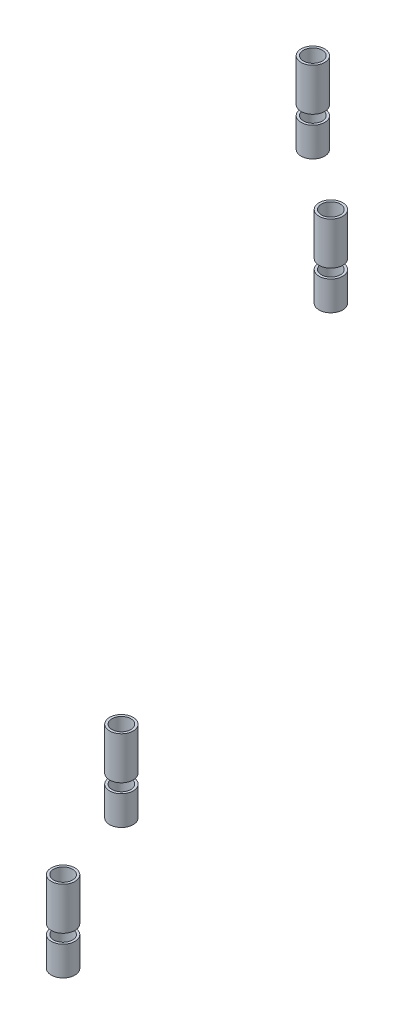
ISO-10303-21;
HEADER;
FILE_DESCRIPTION(('STEP AP214'),'2;1');
FILE_NAME('part.step','',(''),(''),'','','');
FILE_SCHEMA(('AUTOMOTIVE_DESIGN { 1 0 10303 214 1 1 1 1 }'));
ENDSEC;
DATA;
#1=APPLICATION_CONTEXT('core data for automotive mechanical design processes');
#2=APPLICATION_PROTOCOL_DEFINITION('international standard','automotive_design',2000,#1);
#3=PRODUCT_CONTEXT('',#1,'mechanical');
#4=PRODUCT('Part','Part','',(#3));
#5=PRODUCT_RELATED_PRODUCT_CATEGORY('part','',(#4));
#6=PRODUCT_DEFINITION_FORMATION('','',#4);
#7=PRODUCT_DEFINITION_CONTEXT('part definition',#1,'design');
#8=PRODUCT_DEFINITION('design','',#6,#7);
#9=PRODUCT_DEFINITION_SHAPE('','',#8);
#10=(LENGTH_UNIT() NAMED_UNIT(*) SI_UNIT(.MILLI.,.METRE.));
#11=(NAMED_UNIT(*) PLANE_ANGLE_UNIT() SI_UNIT($,.RADIAN.));
#12=(NAMED_UNIT(*) SI_UNIT($,.STERADIAN.) SOLID_ANGLE_UNIT());
#13=UNCERTAINTY_MEASURE_WITH_UNIT(LENGTH_MEASURE(1.E-05),#10,'distance_accuracy_value','');
#14=(GEOMETRIC_REPRESENTATION_CONTEXT(3) GLOBAL_UNCERTAINTY_ASSIGNED_CONTEXT((#13)) GLOBAL_UNIT_ASSIGNED_CONTEXT((#10,
#11,#12)) REPRESENTATION_CONTEXT('',''));
#15=CARTESIAN_POINT('',(0.,0.,0.));
#16=DIRECTION('',(0.,0.,1.));
#17=DIRECTION('',(1.,0.,0.));
#18=AXIS2_PLACEMENT_3D('',#15,#16,#17);
#19=CARTESIAN_POINT('',(-85.5135337309305,461.5,411.920534849113));
#20=DIRECTION('',(0.,-1.,0.));
#21=DIRECTION('',(0.,0.,-1.));
#22=AXIS2_PLACEMENT_3D('',#19,#20,#21);
#23=PLANE('',#22);
#24=CARTESIAN_POINT('',(-85.5135337309305,461.5,411.920534849113));
#25=DIRECTION('',(0.,-1.,0.));
#26=DIRECTION('',(0.,0.,-1.));
#27=AXIS2_PLACEMENT_3D('',#24,#25,#26);
#28=CIRCLE('',#27,2.50000000000001);
#29=CARTESIAN_POINT('',(-85.5135337309305,461.5,409.420534849113));
#30=VERTEX_POINT('',#29);
#31=EDGE_CURVE('E49',#30,#30,#28,.T.);
#32=ORIENTED_EDGE('',*,*,#31,.F.);
#33=EDGE_LOOP('',(#32));
#34=FACE_BOUND('',#33,.T.);
#35=CARTESIAN_POINT('',(-85.5135337309305,461.5,411.920534849113));
#36=DIRECTION('',(0.,-1.,0.));
#37=DIRECTION('',(0.,0.,-1.));
#38=AXIS2_PLACEMENT_3D('',#35,#36,#37);
#39=CIRCLE('',#38,1.99999999999998);
#40=CARTESIAN_POINT('',(-85.5135337309305,461.5,409.920534849113));
#41=VERTEX_POINT('',#40);
#42=EDGE_CURVE('E58',#41,#41,#39,.T.);
#43=ORIENTED_EDGE('',*,*,#42,.T.);
#44=EDGE_LOOP('',(#43));
#45=FACE_BOUND('',#44,.T.);
#46=ADVANCED_FACE('F42',(#34,#45),#23,.F.);
#47=CARTESIAN_POINT('',(-85.5135337309305,448.228932188135,411.920534849113));
#48=DIRECTION('',(0.,1.,0.));
#49=DIRECTION('',(0.,0.,1.));
#50=AXIS2_PLACEMENT_3D('',#47,#48,#49);
#51=CYLINDRICAL_SURFACE('',#50,2.50000000000001);
#52=CARTESIAN_POINT('',(-85.5135337309305,455.3,411.920534849113));
#53=DIRECTION('',(0.,1.,0.));
#54=DIRECTION('',(0.,0.,1.));
#55=AXIS2_PLACEMENT_3D('',#52,#53,#54);
#56=CIRCLE('',#55,2.50000000000001);
#57=CARTESIAN_POINT('',(-85.5135337309305,455.3,414.420534849113));
#58=VERTEX_POINT('',#57);
#59=EDGE_CURVE('E53',#58,#58,#56,.T.);
#60=ORIENTED_EDGE('',*,*,#59,.T.);
#61=EDGE_LOOP('',(#60));
#62=FACE_BOUND('',#61,.T.);
#63=ORIENTED_EDGE('',*,*,#31,.T.);
#64=EDGE_LOOP('',(#63));
#65=FACE_BOUND('',#64,.T.);
#66=ADVANCED_FACE('F66',(#62,#65),#51,.T.);
#67=CARTESIAN_POINT('',(-85.5135337309305,448.228932188135,411.920534849113));
#68=DIRECTION('',(0.,1.,0.));
#69=DIRECTION('',(0.,0.,1.));
#70=AXIS2_PLACEMENT_3D('',#67,#68,#69);
#71=CYLINDRICAL_SURFACE('',#70,1.99999999999998);
#72=CARTESIAN_POINT('',(-85.5135337309305,455.3,411.920534849113));
#73=DIRECTION('',(0.,1.,0.));
#74=DIRECTION('',(0.,0.,1.));
#75=AXIS2_PLACEMENT_3D('',#72,#73,#74);
#76=CIRCLE('',#75,1.99999999999998);
#77=CARTESIAN_POINT('',(-85.5135337309305,455.3,413.920534849113));
#78=VERTEX_POINT('',#77);
#79=EDGE_CURVE('E11',#78,#78,#76,.T.);
#80=ORIENTED_EDGE('',*,*,#79,.F.);
#81=EDGE_LOOP('',(#80));
#82=FACE_BOUND('',#81,.T.);
#83=ORIENTED_EDGE('',*,*,#42,.F.);
#84=EDGE_LOOP('',(#83));
#85=FACE_BOUND('',#84,.T.);
#86=ADVANCED_FACE('F64',(#82,#85),#71,.F.);
#87=CARTESIAN_POINT('',(-199.166238959109,455.3,261.544556892225));
#88=DIRECTION('',(0.,1.,0.));
#89=DIRECTION('',(0.,0.,1.));
#90=AXIS2_PLACEMENT_3D('',#87,#88,#89);
#91=PLANE('',#90);
#92=ORIENTED_EDGE('',*,*,#79,.T.);
#93=EDGE_LOOP('',(#92));
#94=FACE_BOUND('',#93,.T.);
#95=ORIENTED_EDGE('',*,*,#59,.F.);
#96=EDGE_LOOP('',(#95));
#97=FACE_BOUND('',#96,.T.);
#98=ADVANCED_FACE('F44',(#94,#97),#91,.F.);
#99=CLOSED_SHELL('',(#46,#66,#86,#98));
#100=MANIFOLD_SOLID_BREP('B2',#99);
#101=CARTESIAN_POINT('',(-106.941386537863,461.5,378.144106321449));
#102=DIRECTION('',(0.,-1.,0.));
#103=DIRECTION('',(0.,0.,-1.));
#104=AXIS2_PLACEMENT_3D('',#101,#102,#103);
#105=PLANE('',#104);
#106=CARTESIAN_POINT('',(-106.941386537863,461.5,378.144106321449));
#107=DIRECTION('',(0.,-1.,0.));
#108=DIRECTION('',(0.,0.,-1.));
#109=AXIS2_PLACEMENT_3D('',#106,#107,#108);
#110=CIRCLE('',#109,2.50000000000002);
#111=CARTESIAN_POINT('',(-106.941386537863,461.5,375.644106321449));
#112=VERTEX_POINT('',#111);
#113=EDGE_CURVE('E119',#112,#112,#110,.T.);
#114=ORIENTED_EDGE('',*,*,#113,.F.);
#115=EDGE_LOOP('',(#114));
#116=FACE_BOUND('',#115,.T.);
#117=CARTESIAN_POINT('',(-106.941386537863,461.5,378.144106321449));
#118=DIRECTION('',(0.,-1.,0.));
#119=DIRECTION('',(0.,0.,-1.));
#120=AXIS2_PLACEMENT_3D('',#117,#118,#119);
#121=CIRCLE('',#120,2.00000000000001);
#122=CARTESIAN_POINT('',(-106.941386537863,461.5,376.144106321449));
#123=VERTEX_POINT('',#122);
#124=EDGE_CURVE('E128',#123,#123,#121,.T.);
#125=ORIENTED_EDGE('',*,*,#124,.T.);
#126=EDGE_LOOP('',(#125));
#127=FACE_BOUND('',#126,.T.);
#128=ADVANCED_FACE('F112',(#116,#127),#105,.F.);
#129=CARTESIAN_POINT('',(-106.941386537863,448.228932188135,378.144106321449));
#130=DIRECTION('',(0.,1.,0.));
#131=DIRECTION('',(0.,0.,1.));
#132=AXIS2_PLACEMENT_3D('',#129,#130,#131);
#133=CYLINDRICAL_SURFACE('',#132,2.50000000000002);
#134=CARTESIAN_POINT('',(-106.941386537863,455.3,378.144106321449));
#135=DIRECTION('',(0.,1.,0.));
#136=DIRECTION('',(0.,0.,1.));
#137=AXIS2_PLACEMENT_3D('',#134,#135,#136);
#138=CIRCLE('',#137,2.50000000000002);
#139=CARTESIAN_POINT('',(-106.941386537863,455.3,380.644106321449));
#140=VERTEX_POINT('',#139);
#141=EDGE_CURVE('E123',#140,#140,#138,.T.);
#142=ORIENTED_EDGE('',*,*,#141,.T.);
#143=EDGE_LOOP('',(#142));
#144=FACE_BOUND('',#143,.T.);
#145=ORIENTED_EDGE('',*,*,#113,.T.);
#146=EDGE_LOOP('',(#145));
#147=FACE_BOUND('',#146,.T.);
#148=ADVANCED_FACE('F136',(#144,#147),#133,.T.);
#149=CARTESIAN_POINT('',(-106.941386537863,448.228932188135,378.144106321449));
#150=DIRECTION('',(0.,1.,0.));
#151=DIRECTION('',(0.,0.,1.));
#152=AXIS2_PLACEMENT_3D('',#149,#150,#151);
#153=CYLINDRICAL_SURFACE('',#152,2.00000000000001);
#154=CARTESIAN_POINT('',(-106.941386537863,455.3,378.144106321449));
#155=DIRECTION('',(0.,1.,0.));
#156=DIRECTION('',(0.,0.,1.));
#157=AXIS2_PLACEMENT_3D('',#154,#155,#156);
#158=CIRCLE('',#157,2.00000000000001);
#159=CARTESIAN_POINT('',(-106.941386537863,455.3,380.144106321449));
#160=VERTEX_POINT('',#159);
#161=EDGE_CURVE('E41',#160,#160,#158,.T.);
#162=ORIENTED_EDGE('',*,*,#161,.F.);
#163=EDGE_LOOP('',(#162));
#164=FACE_BOUND('',#163,.T.);
#165=ORIENTED_EDGE('',*,*,#124,.F.);
#166=EDGE_LOOP('',(#165));
#167=FACE_BOUND('',#166,.T.);
#168=ADVANCED_FACE('F134',(#164,#167),#153,.F.);
#169=CARTESIAN_POINT('',(-199.166238959109,455.3,261.544556892225));
#170=DIRECTION('',(0.,1.,0.));
#171=DIRECTION('',(0.,0.,1.));
#172=AXIS2_PLACEMENT_3D('',#169,#170,#171);
#173=PLANE('',#172);
#174=ORIENTED_EDGE('',*,*,#161,.T.);
#175=EDGE_LOOP('',(#174));
#176=FACE_BOUND('',#175,.T.);
#177=ORIENTED_EDGE('',*,*,#141,.F.);
#178=EDGE_LOOP('',(#177));
#179=FACE_BOUND('',#178,.T.);
#180=ADVANCED_FACE('F114',(#176,#179),#173,.F.);
#181=CLOSED_SHELL('',(#128,#148,#168,#180));
#182=MANIFOLD_SOLID_BREP('B6',#181);
#183=CARTESIAN_POINT('',(-179.166238959035,461.5,261.544556892205));
#184=DIRECTION('',(0.,-1.,0.));
#185=DIRECTION('',(0.,0.,-1.));
#186=AXIS2_PLACEMENT_3D('',#183,#184,#185);
#187=PLANE('',#186);
#188=CARTESIAN_POINT('',(-179.166238959035,461.5,261.544556892205));
#189=DIRECTION('',(0.,-1.,0.));
#190=DIRECTION('',(0.,0.,-1.));
#191=AXIS2_PLACEMENT_3D('',#188,#189,#190);
#192=CIRCLE('',#191,2.50000000000002);
#193=CARTESIAN_POINT('',(-179.166238959035,461.5,259.044556892205));
#194=VERTEX_POINT('',#193);
#195=EDGE_CURVE('E189',#194,#194,#192,.T.);
#196=ORIENTED_EDGE('',*,*,#195,.F.);
#197=EDGE_LOOP('',(#196));
#198=FACE_BOUND('',#197,.T.);
#199=CARTESIAN_POINT('',(-179.166238959035,461.5,261.544556892205));
#200=DIRECTION('',(0.,-1.,0.));
#201=DIRECTION('',(0.,0.,-1.));
#202=AXIS2_PLACEMENT_3D('',#199,#200,#201);
#203=CIRCLE('',#202,1.99999999694512);
#204=CARTESIAN_POINT('',(-179.166238959035,461.5,259.54455689526));
#205=VERTEX_POINT('',#204);
#206=EDGE_CURVE('E198',#205,#205,#203,.T.);
#207=ORIENTED_EDGE('',*,*,#206,.T.);
#208=EDGE_LOOP('',(#207));
#209=FACE_BOUND('',#208,.T.);
#210=ADVANCED_FACE('F182',(#198,#209),#187,.F.);
#211=CARTESIAN_POINT('',(-179.166238959035,448.228932188135,261.544556892205));
#212=DIRECTION('',(0.,1.,0.));
#213=DIRECTION('',(0.,0.,1.));
#214=AXIS2_PLACEMENT_3D('',#211,#212,#213);
#215=CYLINDRICAL_SURFACE('',#214,2.50000000000002);
#216=CARTESIAN_POINT('',(-179.166238959035,455.3,261.544556892205));
#217=DIRECTION('',(0.,1.,0.));
#218=DIRECTION('',(0.,0.,1.));
#219=AXIS2_PLACEMENT_3D('',#216,#217,#218);
#220=CIRCLE('',#219,2.50000000000002);
#221=CARTESIAN_POINT('',(-179.166238959035,455.3,264.044556892205));
#222=VERTEX_POINT('',#221);
#223=EDGE_CURVE('E193',#222,#222,#220,.T.);
#224=ORIENTED_EDGE('',*,*,#223,.T.);
#225=EDGE_LOOP('',(#224));
#226=FACE_BOUND('',#225,.T.);
#227=ORIENTED_EDGE('',*,*,#195,.T.);
#228=EDGE_LOOP('',(#227));
#229=FACE_BOUND('',#228,.T.);
#230=ADVANCED_FACE('F206',(#226,#229),#215,.T.);
#231=CARTESIAN_POINT('',(-179.166238959035,448.228932188135,261.544556892205));
#232=DIRECTION('',(0.,1.,0.));
#233=DIRECTION('',(0.,0.,1.));
#234=AXIS2_PLACEMENT_3D('',#231,#232,#233);
#235=CYLINDRICAL_SURFACE('',#234,1.99999999694512);
#236=CARTESIAN_POINT('',(-179.166238959035,455.3,261.544556892205));
#237=DIRECTION('',(0.,1.,0.));
#238=DIRECTION('',(0.,0.,1.));
#239=AXIS2_PLACEMENT_3D('',#236,#237,#238);
#240=CIRCLE('',#239,1.99999999694512);
#241=CARTESIAN_POINT('',(-179.166238959035,455.3,263.54455688915));
#242=VERTEX_POINT('',#241);
#243=EDGE_CURVE('E111',#242,#242,#240,.T.);
#244=ORIENTED_EDGE('',*,*,#243,.F.);
#245=EDGE_LOOP('',(#244));
#246=FACE_BOUND('',#245,.T.);
#247=ORIENTED_EDGE('',*,*,#206,.F.);
#248=EDGE_LOOP('',(#247));
#249=FACE_BOUND('',#248,.T.);
#250=ADVANCED_FACE('F204',(#246,#249),#235,.F.);
#251=CARTESIAN_POINT('',(-199.166238959109,455.3,261.544556892225));
#252=DIRECTION('',(0.,1.,0.));
#253=DIRECTION('',(0.,0.,1.));
#254=AXIS2_PLACEMENT_3D('',#251,#252,#253);
#255=PLANE('',#254);
#256=ORIENTED_EDGE('',*,*,#243,.T.);
#257=EDGE_LOOP('',(#256));
#258=FACE_BOUND('',#257,.T.);
#259=ORIENTED_EDGE('',*,*,#223,.F.);
#260=EDGE_LOOP('',(#259));
#261=FACE_BOUND('',#260,.T.);
#262=ADVANCED_FACE('F184',(#258,#261),#255,.F.);
#263=CLOSED_SHELL('',(#210,#230,#250,#262));
#264=MANIFOLD_SOLID_BREP('B36',#263);
#265=CARTESIAN_POINT('',(-209.294177746774,461.5,235.232823684332));
#266=DIRECTION('',(0.,-1.,0.));
#267=DIRECTION('',(0.,0.,-1.));
#268=AXIS2_PLACEMENT_3D('',#265,#266,#267);
#269=PLANE('',#268);
#270=CARTESIAN_POINT('',(-209.294177746774,461.5,235.232823684332));
#271=DIRECTION('',(0.,-1.,0.));
#272=DIRECTION('',(0.,0.,-1.));
#273=AXIS2_PLACEMENT_3D('',#270,#271,#272);
#274=CIRCLE('',#273,2.5);
#275=CARTESIAN_POINT('',(-209.294177746774,461.5,232.732823684332));
#276=VERTEX_POINT('',#275);
#277=EDGE_CURVE('E259',#276,#276,#274,.T.);
#278=ORIENTED_EDGE('',*,*,#277,.F.);
#279=EDGE_LOOP('',(#278));
#280=FACE_BOUND('',#279,.T.);
#281=CARTESIAN_POINT('',(-209.294177746774,461.5,235.232823684332));
#282=DIRECTION('',(0.,-1.,0.));
#283=DIRECTION('',(0.,0.,-1.));
#284=AXIS2_PLACEMENT_3D('',#281,#282,#283);
#285=CIRCLE('',#284,2.00000000306296);
#286=CARTESIAN_POINT('',(-209.294177746774,461.5,233.232823681269));
#287=VERTEX_POINT('',#286);
#288=EDGE_CURVE('E268',#287,#287,#285,.T.);
#289=ORIENTED_EDGE('',*,*,#288,.T.);
#290=EDGE_LOOP('',(#289));
#291=FACE_BOUND('',#290,.T.);
#292=ADVANCED_FACE('F252',(#280,#291),#269,.F.);
#293=CARTESIAN_POINT('',(-209.294177746774,448.228932188135,235.232823684332));
#294=DIRECTION('',(0.,1.,0.));
#295=DIRECTION('',(0.,0.,1.));
#296=AXIS2_PLACEMENT_3D('',#293,#294,#295);
#297=CYLINDRICAL_SURFACE('',#296,2.5);
#298=CARTESIAN_POINT('',(-209.294177746774,455.3,235.232823684332));
#299=DIRECTION('',(0.,1.,0.));
#300=DIRECTION('',(0.,0.,1.));
#301=AXIS2_PLACEMENT_3D('',#298,#299,#300);
#302=CIRCLE('',#301,2.5);
#303=CARTESIAN_POINT('',(-209.294177746774,455.3,237.732823684332));
#304=VERTEX_POINT('',#303);
#305=EDGE_CURVE('E263',#304,#304,#302,.T.);
#306=ORIENTED_EDGE('',*,*,#305,.T.);
#307=EDGE_LOOP('',(#306));
#308=FACE_BOUND('',#307,.T.);
#309=ORIENTED_EDGE('',*,*,#277,.T.);
#310=EDGE_LOOP('',(#309));
#311=FACE_BOUND('',#310,.T.);
#312=ADVANCED_FACE('F276',(#308,#311),#297,.T.);
#313=CARTESIAN_POINT('',(-209.294177746774,448.228932188135,235.232823684332));
#314=DIRECTION('',(0.,1.,0.));
#315=DIRECTION('',(0.,0.,1.));
#316=AXIS2_PLACEMENT_3D('',#313,#314,#315);
#317=CYLINDRICAL_SURFACE('',#316,2.00000000306296);
#318=CARTESIAN_POINT('',(-209.294177746774,455.3,235.232823684332));
#319=DIRECTION('',(0.,1.,0.));
#320=DIRECTION('',(0.,0.,1.));
#321=AXIS2_PLACEMENT_3D('',#318,#319,#320);
#322=CIRCLE('',#321,2.00000000306296);
#323=CARTESIAN_POINT('',(-209.294177746774,455.3,237.232823687395));
#324=VERTEX_POINT('',#323);
#325=EDGE_CURVE('E181',#324,#324,#322,.T.);
#326=ORIENTED_EDGE('',*,*,#325,.F.);
#327=EDGE_LOOP('',(#326));
#328=FACE_BOUND('',#327,.T.);
#329=ORIENTED_EDGE('',*,*,#288,.F.);
#330=EDGE_LOOP('',(#329));
#331=FACE_BOUND('',#330,.T.);
#332=ADVANCED_FACE('F274',(#328,#331),#317,.F.);
#333=CARTESIAN_POINT('',(-199.166238959109,455.3,261.544556892225));
#334=DIRECTION('',(0.,1.,0.));
#335=DIRECTION('',(0.,0.,1.));
#336=AXIS2_PLACEMENT_3D('',#333,#334,#335);
#337=PLANE('',#336);
#338=ORIENTED_EDGE('',*,*,#325,.T.);
#339=EDGE_LOOP('',(#338));
#340=FACE_BOUND('',#339,.T.);
#341=ORIENTED_EDGE('',*,*,#305,.F.);
#342=EDGE_LOOP('',(#341));
#343=FACE_BOUND('',#342,.T.);
#344=ADVANCED_FACE('F254',(#340,#343),#337,.F.);
#345=CLOSED_SHELL('',(#292,#312,#332,#344));
#346=MANIFOLD_SOLID_BREP('B106',#345);
#347=CARTESIAN_POINT('',(-85.5135337309305,472.500000000027,411.920534849113));
#348=DIRECTION('',(0.,-1.,0.));
#349=DIRECTION('',(0.,0.,-1.));
#350=AXIS2_PLACEMENT_3D('',#347,#348,#349);
#351=PLANE('',#350);
#352=CARTESIAN_POINT('',(-85.5135337309305,472.500000000027,411.920534849113));
#353=DIRECTION('',(0.,-1.,0.));
#354=DIRECTION('',(0.,0.,-1.));
#355=AXIS2_PLACEMENT_3D('',#352,#353,#354);
#356=CIRCLE('',#355,2.5);
#357=CARTESIAN_POINT('',(-85.5135337309305,472.500000000027,409.420534849113));
#358=VERTEX_POINT('',#357);
#359=EDGE_CURVE('E329',#358,#358,#356,.T.);
#360=ORIENTED_EDGE('',*,*,#359,.F.);
#361=EDGE_LOOP('',(#360));
#362=FACE_BOUND('',#361,.T.);
#363=CARTESIAN_POINT('',(-85.5135337309305,472.500000000027,411.920534849113));
#364=DIRECTION('',(0.,-1.,0.));
#365=DIRECTION('',(0.,0.,-1.));
#366=AXIS2_PLACEMENT_3D('',#363,#364,#365);
#367=CIRCLE('',#366,2.);
#368=CARTESIAN_POINT('',(-85.5135337309305,472.500000000027,409.920534849113));
#369=VERTEX_POINT('',#368);
#370=EDGE_CURVE('E338',#369,#369,#367,.T.);
#371=ORIENTED_EDGE('',*,*,#370,.T.);
#372=EDGE_LOOP('',(#371));
#373=FACE_BOUND('',#372,.T.);
#374=ADVANCED_FACE('F322',(#362,#373),#351,.F.);
#375=CARTESIAN_POINT('',(-85.5135337309305,456.428932188135,411.920534849113));
#376=DIRECTION('',(0.,1.,0.));
#377=DIRECTION('',(0.,0.,1.));
#378=AXIS2_PLACEMENT_3D('',#375,#376,#377);
#379=CYLINDRICAL_SURFACE('',#378,2.5);
#380=CARTESIAN_POINT('',(-85.5135337309305,463.5,411.920534849113));
#381=DIRECTION('',(0.,1.,0.));
#382=DIRECTION('',(0.,0.,1.));
#383=AXIS2_PLACEMENT_3D('',#380,#381,#382);
#384=CIRCLE('',#383,2.5);
#385=CARTESIAN_POINT('',(-85.5135337309305,463.5,414.420534849113));
#386=VERTEX_POINT('',#385);
#387=EDGE_CURVE('E333',#386,#386,#384,.T.);
#388=ORIENTED_EDGE('',*,*,#387,.T.);
#389=EDGE_LOOP('',(#388));
#390=FACE_BOUND('',#389,.T.);
#391=ORIENTED_EDGE('',*,*,#359,.T.);
#392=EDGE_LOOP('',(#391));
#393=FACE_BOUND('',#392,.T.);
#394=ADVANCED_FACE('F346',(#390,#393),#379,.T.);
#395=CARTESIAN_POINT('',(-85.5135337309305,456.428932188135,411.920534849113));
#396=DIRECTION('',(0.,1.,0.));
#397=DIRECTION('',(0.,0.,1.));
#398=AXIS2_PLACEMENT_3D('',#395,#396,#397);
#399=CYLINDRICAL_SURFACE('',#398,2.);
#400=CARTESIAN_POINT('',(-85.5135337309305,463.5,411.920534849113));
#401=DIRECTION('',(0.,1.,0.));
#402=DIRECTION('',(0.,0.,1.));
#403=AXIS2_PLACEMENT_3D('',#400,#401,#402);
#404=CIRCLE('',#403,2.);
#405=CARTESIAN_POINT('',(-85.5135337309305,463.5,413.920534849113));
#406=VERTEX_POINT('',#405);
#407=EDGE_CURVE('E251',#406,#406,#404,.T.);
#408=ORIENTED_EDGE('',*,*,#407,.F.);
#409=EDGE_LOOP('',(#408));
#410=FACE_BOUND('',#409,.T.);
#411=ORIENTED_EDGE('',*,*,#370,.F.);
#412=EDGE_LOOP('',(#411));
#413=FACE_BOUND('',#412,.T.);
#414=ADVANCED_FACE('F344',(#410,#413),#399,.F.);
#415=CARTESIAN_POINT('',(-268.222443474212,463.5,328.116942343268));
#416=DIRECTION('',(0.,1.,0.));
#417=DIRECTION('',(0.,0.,1.));
#418=AXIS2_PLACEMENT_3D('',#415,#416,#417);
#419=PLANE('',#418);
#420=ORIENTED_EDGE('',*,*,#407,.T.);
#421=EDGE_LOOP('',(#420));
#422=FACE_BOUND('',#421,.T.);
#423=ORIENTED_EDGE('',*,*,#387,.F.);
#424=EDGE_LOOP('',(#423));
#425=FACE_BOUND('',#424,.T.);
#426=ADVANCED_FACE('F324',(#422,#425),#419,.F.);
#427=CLOSED_SHELL('',(#374,#394,#414,#426));
#428=MANIFOLD_SOLID_BREP('B176',#427);
#429=CARTESIAN_POINT('',(-106.941386537863,472.500000000027,378.144106321449));
#430=DIRECTION('',(0.,-1.,0.));
#431=DIRECTION('',(0.,0.,-1.));
#432=AXIS2_PLACEMENT_3D('',#429,#430,#431);
#433=PLANE('',#432);
#434=CARTESIAN_POINT('',(-106.941386537863,472.500000000027,378.144106321449));
#435=DIRECTION('',(0.,-1.,0.));
#436=DIRECTION('',(0.,0.,-1.));
#437=AXIS2_PLACEMENT_3D('',#434,#435,#436);
#438=CIRCLE('',#437,2.5);
#439=CARTESIAN_POINT('',(-106.941386537863,472.500000000027,375.644106321449));
#440=VERTEX_POINT('',#439);
#441=EDGE_CURVE('E399',#440,#440,#438,.T.);
#442=ORIENTED_EDGE('',*,*,#441,.F.);
#443=EDGE_LOOP('',(#442));
#444=FACE_BOUND('',#443,.T.);
#445=CARTESIAN_POINT('',(-106.941386537863,472.500000000027,378.144106321449));
#446=DIRECTION('',(0.,-1.,0.));
#447=DIRECTION('',(0.,0.,-1.));
#448=AXIS2_PLACEMENT_3D('',#445,#446,#447);
#449=CIRCLE('',#448,2.);
#450=CARTESIAN_POINT('',(-106.941386537863,472.500000000027,376.144106321449));
#451=VERTEX_POINT('',#450);
#452=EDGE_CURVE('E408',#451,#451,#449,.T.);
#453=ORIENTED_EDGE('',*,*,#452,.T.);
#454=EDGE_LOOP('',(#453));
#455=FACE_BOUND('',#454,.T.);
#456=ADVANCED_FACE('F392',(#444,#455),#433,.F.);
#457=CARTESIAN_POINT('',(-106.941386537863,456.428932188135,378.144106321449));
#458=DIRECTION('',(0.,1.,0.));
#459=DIRECTION('',(0.,0.,1.));
#460=AXIS2_PLACEMENT_3D('',#457,#458,#459);
#461=CYLINDRICAL_SURFACE('',#460,2.5);
#462=CARTESIAN_POINT('',(-106.941386537863,463.5,378.144106321449));
#463=DIRECTION('',(0.,1.,0.));
#464=DIRECTION('',(0.,0.,1.));
#465=AXIS2_PLACEMENT_3D('',#462,#463,#464);
#466=CIRCLE('',#465,2.5);
#467=CARTESIAN_POINT('',(-106.941386537863,463.5,380.644106321449));
#468=VERTEX_POINT('',#467);
#469=EDGE_CURVE('E403',#468,#468,#466,.T.);
#470=ORIENTED_EDGE('',*,*,#469,.T.);
#471=EDGE_LOOP('',(#470));
#472=FACE_BOUND('',#471,.T.);
#473=ORIENTED_EDGE('',*,*,#441,.T.);
#474=EDGE_LOOP('',(#473));
#475=FACE_BOUND('',#474,.T.);
#476=ADVANCED_FACE('F416',(#472,#475),#461,.T.);
#477=CARTESIAN_POINT('',(-106.941386537863,456.428932188135,378.144106321449));
#478=DIRECTION('',(0.,1.,0.));
#479=DIRECTION('',(0.,0.,1.));
#480=AXIS2_PLACEMENT_3D('',#477,#478,#479);
#481=CYLINDRICAL_SURFACE('',#480,2.);
#482=CARTESIAN_POINT('',(-106.941386537863,463.5,378.144106321449));
#483=DIRECTION('',(0.,1.,0.));
#484=DIRECTION('',(0.,0.,1.));
#485=AXIS2_PLACEMENT_3D('',#482,#483,#484);
#486=CIRCLE('',#485,2.);
#487=CARTESIAN_POINT('',(-106.941386537863,463.5,380.144106321449));
#488=VERTEX_POINT('',#487);
#489=EDGE_CURVE('E321',#488,#488,#486,.T.);
#490=ORIENTED_EDGE('',*,*,#489,.F.);
#491=EDGE_LOOP('',(#490));
#492=FACE_BOUND('',#491,.T.);
#493=ORIENTED_EDGE('',*,*,#452,.F.);
#494=EDGE_LOOP('',(#493));
#495=FACE_BOUND('',#494,.T.);
#496=ADVANCED_FACE('F414',(#492,#495),#481,.F.);
#497=CARTESIAN_POINT('',(-268.222443474212,463.5,328.116942343268));
#498=DIRECTION('',(0.,1.,0.));
#499=DIRECTION('',(0.,0.,1.));
#500=AXIS2_PLACEMENT_3D('',#497,#498,#499);
#501=PLANE('',#500);
#502=ORIENTED_EDGE('',*,*,#489,.T.);
#503=EDGE_LOOP('',(#502));
#504=FACE_BOUND('',#503,.T.);
#505=ORIENTED_EDGE('',*,*,#469,.F.);
#506=EDGE_LOOP('',(#505));
#507=FACE_BOUND('',#506,.T.);
#508=ADVANCED_FACE('F394',(#504,#507),#501,.F.);
#509=CLOSED_SHELL('',(#456,#476,#496,#508));
#510=MANIFOLD_SOLID_BREP('B246',#509);
#511=CARTESIAN_POINT('',(-179.166238959035,472.500000000027,261.544556892205));
#512=DIRECTION('',(0.,-1.,0.));
#513=DIRECTION('',(0.,0.,-1.));
#514=AXIS2_PLACEMENT_3D('',#511,#512,#513);
#515=PLANE('',#514);
#516=CARTESIAN_POINT('',(-179.166238959035,472.500000000027,261.544556892205));
#517=DIRECTION('',(0.,-1.,0.));
#518=DIRECTION('',(0.,0.,-1.));
#519=AXIS2_PLACEMENT_3D('',#516,#517,#518);
#520=CIRCLE('',#519,2.5);
#521=CARTESIAN_POINT('',(-179.166238959035,472.500000000027,259.044556892205));
#522=VERTEX_POINT('',#521);
#523=EDGE_CURVE('E468',#522,#522,#520,.T.);
#524=ORIENTED_EDGE('',*,*,#523,.F.);
#525=EDGE_LOOP('',(#524));
#526=FACE_BOUND('',#525,.T.);
#527=CARTESIAN_POINT('',(-179.166238959035,472.500000000027,261.544556892205));
#528=DIRECTION('',(0.,-1.,0.));
#529=DIRECTION('',(0.,0.,-1.));
#530=AXIS2_PLACEMENT_3D('',#527,#528,#529);
#531=CIRCLE('',#530,2.00000000000012);
#532=CARTESIAN_POINT('',(-179.166238959035,472.500000000027,259.544556892205));
#533=VERTEX_POINT('',#532);
#534=EDGE_CURVE('E477',#533,#533,#531,.T.);
#535=ORIENTED_EDGE('',*,*,#534,.T.);
#536=EDGE_LOOP('',(#535));
#537=FACE_BOUND('',#536,.T.);
#538=ADVANCED_FACE('F461',(#526,#537),#515,.F.);
#539=CARTESIAN_POINT('',(-179.166238959035,456.428932188135,261.544556892205));
#540=DIRECTION('',(0.,1.,0.));
#541=DIRECTION('',(0.,0.,1.));
#542=AXIS2_PLACEMENT_3D('',#539,#540,#541);
#543=CYLINDRICAL_SURFACE('',#542,2.5);
#544=CARTESIAN_POINT('',(-179.166238959035,463.5,261.544556892205));
#545=DIRECTION('',(0.,1.,0.));
#546=DIRECTION('',(0.,0.,1.));
#547=AXIS2_PLACEMENT_3D('',#544,#545,#546);
#548=CIRCLE('',#547,2.5);
#549=CARTESIAN_POINT('',(-179.166238959035,463.5,264.044556892205));
#550=VERTEX_POINT('',#549);
#551=EDGE_CURVE('E472',#550,#550,#548,.T.);
#552=ORIENTED_EDGE('',*,*,#551,.T.);
#553=EDGE_LOOP('',(#552));
#554=FACE_BOUND('',#553,.T.);
#555=ORIENTED_EDGE('',*,*,#523,.T.);
#556=EDGE_LOOP('',(#555));
#557=FACE_BOUND('',#556,.T.);
#558=ADVANCED_FACE('F485',(#554,#557),#543,.T.);
#559=CARTESIAN_POINT('',(-179.166238959035,456.428932188135,261.544556892205));
#560=DIRECTION('',(0.,1.,0.));
#561=DIRECTION('',(0.,0.,1.));
#562=AXIS2_PLACEMENT_3D('',#559,#560,#561);
#563=CYLINDRICAL_SURFACE('',#562,2.00000000000012);
#564=CARTESIAN_POINT('',(-179.166238960447,463.5,261.544556895064));
#565=DIRECTION('',(0.,1.,0.));
#566=DIRECTION('',(0.,0.,1.));
#567=AXIS2_PLACEMENT_3D('',#564,#565,#566);
#568=CIRCLE('',#567,2.0000000000001);
#569=CARTESIAN_POINT('',(-179.166238960447,463.5,263.544556895064));
#570=VERTEX_POINT('',#569);
#571=EDGE_CURVE('E391',#570,#570,#568,.T.);
#572=ORIENTED_EDGE('',*,*,#571,.F.);
#573=EDGE_LOOP('',(#572));
#574=FACE_BOUND('',#573,.T.);
#575=ORIENTED_EDGE('',*,*,#534,.F.);
#576=EDGE_LOOP('',(#575));
#577=FACE_BOUND('',#576,.T.);
#578=ADVANCED_FACE('F483',(#574,#577),#563,.F.);
#579=CARTESIAN_POINT('',(-268.222443474212,463.5,328.116942343268));
#580=DIRECTION('',(0.,1.,0.));
#581=DIRECTION('',(0.,0.,1.));
#582=AXIS2_PLACEMENT_3D('',#579,#580,#581);
#583=PLANE('',#582);
#584=ORIENTED_EDGE('',*,*,#571,.T.);
#585=EDGE_LOOP('',(#584));
#586=FACE_BOUND('',#585,.T.);
#587=ORIENTED_EDGE('',*,*,#551,.F.);
#588=EDGE_LOOP('',(#587));
#589=FACE_BOUND('',#588,.T.);
#590=ADVANCED_FACE('F463',(#586,#589),#583,.F.);
#591=CLOSED_SHELL('',(#538,#558,#578,#590));
#592=MANIFOLD_SOLID_BREP('B316',#591);
#593=CARTESIAN_POINT('',(-209.294177746774,472.500000000027,235.232823684332));
#594=DIRECTION('',(0.,-1.,0.));
#595=DIRECTION('',(0.,0.,-1.));
#596=AXIS2_PLACEMENT_3D('',#593,#594,#595);
#597=PLANE('',#596);
#598=CARTESIAN_POINT('',(-209.294177746774,472.500000000027,235.232823684332));
#599=DIRECTION('',(0.,-1.,0.));
#600=DIRECTION('',(0.,0.,-1.));
#601=AXIS2_PLACEMENT_3D('',#598,#599,#600);
#602=CIRCLE('',#601,2.5);
#603=CARTESIAN_POINT('',(-209.294177746774,472.500000000027,232.732823684332));
#604=VERTEX_POINT('',#603);
#605=EDGE_CURVE('E530',#604,#604,#602,.T.);
#606=ORIENTED_EDGE('',*,*,#605,.F.);
#607=EDGE_LOOP('',(#606));
#608=FACE_BOUND('',#607,.T.);
#609=CARTESIAN_POINT('',(-209.294177746774,472.500000000027,235.232823684332));
#610=DIRECTION('',(0.,-1.,0.));
#611=DIRECTION('',(0.,0.,-1.));
#612=AXIS2_PLACEMENT_3D('',#609,#610,#611);
#613=CIRCLE('',#612,2.00000000000011);
#614=CARTESIAN_POINT('',(-209.294177746774,472.500000000027,233.232823684331));
#615=VERTEX_POINT('',#614);
#616=EDGE_CURVE('E539',#615,#615,#613,.T.);
#617=ORIENTED_EDGE('',*,*,#616,.T.);
#618=EDGE_LOOP('',(#617));
#619=FACE_BOUND('',#618,.T.);
#620=ADVANCED_FACE('F523',(#608,#619),#597,.F.);
#621=CARTESIAN_POINT('',(-209.294177746774,456.428932188135,235.232823684332));
#622=DIRECTION('',(0.,1.,0.));
#623=DIRECTION('',(0.,0.,1.));
#624=AXIS2_PLACEMENT_3D('',#621,#622,#623);
#625=CYLINDRICAL_SURFACE('',#624,2.5);
#626=CARTESIAN_POINT('',(-209.294177746774,463.5,235.232823684332));
#627=DIRECTION('',(0.,1.,0.));
#628=DIRECTION('',(0.,0.,1.));
#629=AXIS2_PLACEMENT_3D('',#626,#627,#628);
#630=CIRCLE('',#629,2.5);
#631=CARTESIAN_POINT('',(-209.294177746774,463.5,237.732823684332));
#632=VERTEX_POINT('',#631);
#633=EDGE_CURVE('E534',#632,#632,#630,.T.);
#634=ORIENTED_EDGE('',*,*,#633,.T.);
#635=EDGE_LOOP('',(#634));
#636=FACE_BOUND('',#635,.T.);
#637=ORIENTED_EDGE('',*,*,#605,.T.);
#638=EDGE_LOOP('',(#637));
#639=FACE_BOUND('',#638,.T.);
#640=ADVANCED_FACE('F547',(#636,#639),#625,.T.);
#641=CARTESIAN_POINT('',(-209.294177746774,456.428932188135,235.232823684332));
#642=DIRECTION('',(0.,1.,0.));
#643=DIRECTION('',(0.,0.,1.));
#644=AXIS2_PLACEMENT_3D('',#641,#642,#643);
#645=CYLINDRICAL_SURFACE('',#644,2.00000000000011);
#646=CARTESIAN_POINT('',(-209.294177748143,463.5,235.232823687142));
#647=DIRECTION('',(0.,1.,0.));
#648=DIRECTION('',(0.,0.,1.));
#649=AXIS2_PLACEMENT_3D('',#646,#647,#648);
#650=CIRCLE('',#649,2.0000000000001);
#651=CARTESIAN_POINT('',(-209.294177748143,463.5,237.232823687143));
#652=VERTEX_POINT('',#651);
#653=EDGE_CURVE('E460',#652,#652,#650,.T.);
#654=ORIENTED_EDGE('',*,*,#653,.F.);
#655=EDGE_LOOP('',(#654));
#656=FACE_BOUND('',#655,.T.);
#657=ORIENTED_EDGE('',*,*,#616,.F.);
#658=EDGE_LOOP('',(#657));
#659=FACE_BOUND('',#658,.T.);
#660=ADVANCED_FACE('F545',(#656,#659),#645,.F.);
#661=CARTESIAN_POINT('',(-268.222443474212,463.5,328.116942343268));
#662=DIRECTION('',(0.,1.,0.));
#663=DIRECTION('',(0.,0.,1.));
#664=AXIS2_PLACEMENT_3D('',#661,#662,#663);
#665=PLANE('',#664);
#666=ORIENTED_EDGE('',*,*,#653,.T.);
#667=EDGE_LOOP('',(#666));
#668=FACE_BOUND('',#667,.T.);
#669=ORIENTED_EDGE('',*,*,#633,.F.);
#670=EDGE_LOOP('',(#669));
#671=FACE_BOUND('',#670,.T.);
#672=ADVANCED_FACE('F525',(#668,#671),#665,.F.);
#673=CLOSED_SHELL('',(#620,#640,#660,#672));
#674=MANIFOLD_SOLID_BREP('B386',#673);
#675=ADVANCED_BREP_SHAPE_REPRESENTATION('',(#18,#100,#182,#264,#346,#428,#510,#592,#674),#14);
#676=SHAPE_DEFINITION_REPRESENTATION(#9,#675);
ENDSEC;
END-ISO-10303-21;
